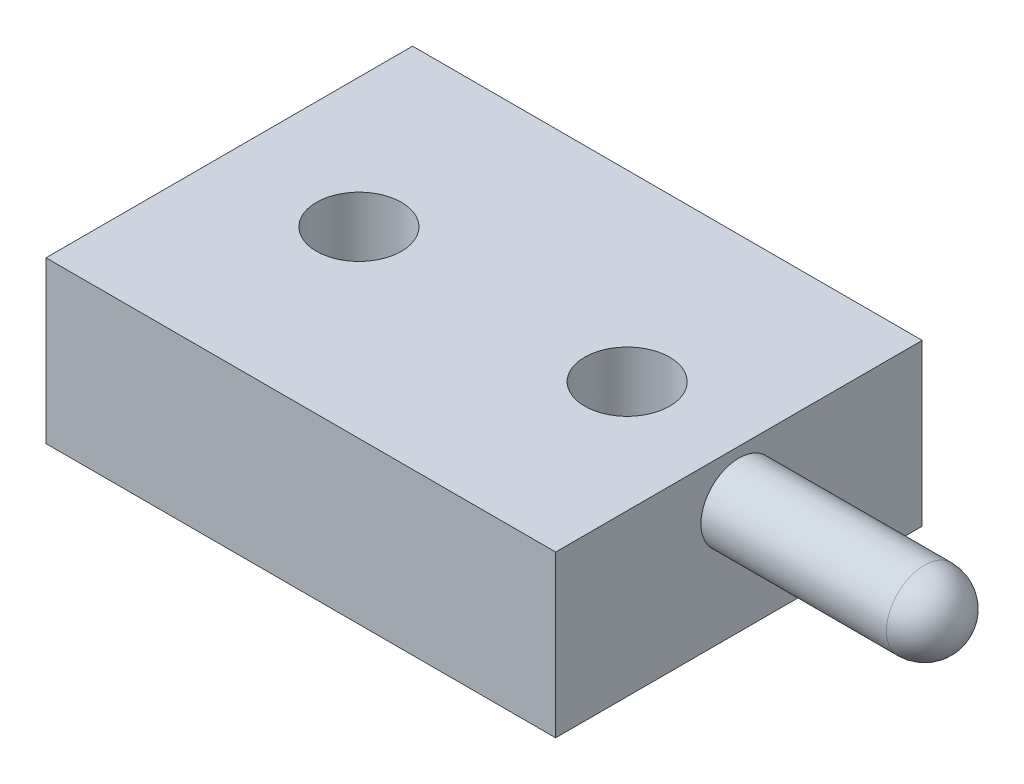
ISO-10303-21;
HEADER;
FILE_DESCRIPTION(('STEP AP214'),'2;1');
FILE_NAME('part.step','',(''),(''),'','','');
FILE_SCHEMA(('AUTOMOTIVE_DESIGN { 1 0 10303 214 1 1 1 1 }'));
ENDSEC;
DATA;
#1=APPLICATION_CONTEXT('core data for automotive mechanical design processes');
#2=APPLICATION_PROTOCOL_DEFINITION('international standard','automotive_design',2000,#1);
#3=PRODUCT_CONTEXT('',#1,'mechanical');
#4=PRODUCT('Part','Part','',(#3));
#5=PRODUCT_RELATED_PRODUCT_CATEGORY('part','',(#4));
#6=PRODUCT_DEFINITION_FORMATION('','',#4);
#7=PRODUCT_DEFINITION_CONTEXT('part definition',#1,'design');
#8=PRODUCT_DEFINITION('design','',#6,#7);
#9=PRODUCT_DEFINITION_SHAPE('','',#8);
#10=(LENGTH_UNIT() NAMED_UNIT(*) SI_UNIT(.MILLI.,.METRE.));
#11=(NAMED_UNIT(*) PLANE_ANGLE_UNIT() SI_UNIT($,.RADIAN.));
#12=(NAMED_UNIT(*) SI_UNIT($,.STERADIAN.) SOLID_ANGLE_UNIT());
#13=UNCERTAINTY_MEASURE_WITH_UNIT(LENGTH_MEASURE(1.E-05),#10,'distance_accuracy_value','');
#14=(GEOMETRIC_REPRESENTATION_CONTEXT(3) GLOBAL_UNCERTAINTY_ASSIGNED_CONTEXT((#13)) GLOBAL_UNIT_ASSIGNED_CONTEXT((#10,
#11,#12)) REPRESENTATION_CONTEXT('',''));
#15=CARTESIAN_POINT('',(0.,0.,0.));
#16=DIRECTION('',(0.,0.,1.));
#17=DIRECTION('',(1.,0.,0.));
#18=AXIS2_PLACEMENT_3D('',#15,#16,#17);
#19=CARTESIAN_POINT('',(5.7,-1.8,0.));
#20=DIRECTION('',(1.,0.,0.));
#21=DIRECTION('',(0.,0.,-1.));
#22=AXIS2_PLACEMENT_3D('',#19,#20,#21);
#23=PLANE('',#22);
#24=DIRECTION('',(0.,0.,-1.));
#25=VECTOR('',#24,1.);
#26=CARTESIAN_POINT('',(5.7,0.,0.));
#27=LINE('',#26,#25);
#28=CARTESIAN_POINT('',(5.7,0.,4.1));
#29=VERTEX_POINT('',#28);
#30=CARTESIAN_POINT('',(5.7,0.,0.));
#31=VERTEX_POINT('',#30);
#32=EDGE_CURVE('E86',#29,#31,#27,.T.);
#33=ORIENTED_EDGE('',*,*,#32,.F.);
#34=DIRECTION('',(0.,1.,0.));
#35=VECTOR('',#34,1.);
#36=CARTESIAN_POINT('',(5.7,-1.8,4.1));
#37=LINE('',#36,#35);
#38=CARTESIAN_POINT('',(5.7,-1.8,4.1));
#39=VERTEX_POINT('',#38);
#40=EDGE_CURVE('E81',#39,#29,#37,.T.);
#41=ORIENTED_EDGE('',*,*,#40,.F.);
#42=DIRECTION('',(0.,0.,-1.));
#43=VECTOR('',#42,1.);
#44=CARTESIAN_POINT('',(5.7,-1.8,0.));
#45=LINE('',#44,#43);
#46=CARTESIAN_POINT('',(5.7,-1.8,0.));
#47=VERTEX_POINT('',#46);
#48=EDGE_CURVE('E84',#39,#47,#45,.T.);
#49=ORIENTED_EDGE('',*,*,#48,.T.);
#50=DIRECTION('',(0.,1.,0.));
#51=VECTOR('',#50,1.);
#52=CARTESIAN_POINT('',(5.7,-1.8,0.));
#53=LINE('',#52,#51);
#54=EDGE_CURVE('E67',#47,#31,#53,.T.);
#55=ORIENTED_EDGE('',*,*,#54,.T.);
#56=EDGE_LOOP('',(#33,#41,#49,#55));
#57=FACE_BOUND('',#56,.T.);
#58=CARTESIAN_POINT('',(5.7,-0.54,2.05));
#59=DIRECTION('',(1.,0.,0.));
#60=DIRECTION('',(0.,0.,-1.));
#61=AXIS2_PLACEMENT_3D('',#58,#59,#60);
#62=CIRCLE('',#61,0.425);
#63=CARTESIAN_POINT('',(5.7,-0.54,1.625));
#64=VERTEX_POINT('',#63);
#65=EDGE_CURVE('E106',#64,#64,#62,.T.);
#66=ORIENTED_EDGE('',*,*,#65,.F.);
#67=EDGE_LOOP('',(#66));
#68=FACE_BOUND('',#67,.T.);
#69=ADVANCED_FACE('F34',(#57,#68),#23,.T.);
#70=CARTESIAN_POINT('',(0.,-1.8,0.));
#71=DIRECTION('',(-1.,0.,0.));
#72=DIRECTION('',(0.,0.,1.));
#73=AXIS2_PLACEMENT_3D('',#70,#71,#72);
#74=PLANE('',#73);
#75=DIRECTION('',(0.,0.,1.));
#76=VECTOR('',#75,1.);
#77=CARTESIAN_POINT('',(0.,0.,0.));
#78=LINE('',#77,#76);
#79=CARTESIAN_POINT('',(0.,0.,0.));
#80=VERTEX_POINT('',#79);
#81=CARTESIAN_POINT('',(0.,0.,4.1));
#82=VERTEX_POINT('',#81);
#83=EDGE_CURVE('E102',#80,#82,#78,.T.);
#84=ORIENTED_EDGE('',*,*,#83,.F.);
#85=DIRECTION('',(0.,1.,0.));
#86=VECTOR('',#85,1.);
#87=CARTESIAN_POINT('',(0.,-1.8,0.));
#88=LINE('',#87,#86);
#89=CARTESIAN_POINT('',(0.,-1.8,0.));
#90=VERTEX_POINT('',#89);
#91=EDGE_CURVE('E43',#90,#80,#88,.T.);
#92=ORIENTED_EDGE('',*,*,#91,.F.);
#93=DIRECTION('',(0.,0.,1.));
#94=VECTOR('',#93,1.);
#95=CARTESIAN_POINT('',(0.,-1.8,0.));
#96=LINE('',#95,#94);
#97=CARTESIAN_POINT('',(0.,-1.8,4.1));
#98=VERTEX_POINT('',#97);
#99=EDGE_CURVE('E95',#90,#98,#96,.T.);
#100=ORIENTED_EDGE('',*,*,#99,.T.);
#101=DIRECTION('',(0.,1.,0.));
#102=VECTOR('',#101,1.);
#103=CARTESIAN_POINT('',(0.,-1.8,4.1));
#104=LINE('',#103,#102);
#105=EDGE_CURVE('E78',#98,#82,#104,.T.);
#106=ORIENTED_EDGE('',*,*,#105,.T.);
#107=EDGE_LOOP('',(#84,#92,#100,#106));
#108=FACE_BOUND('',#107,.T.);
#109=ADVANCED_FACE('F112',(#108),#74,.T.);
#110=CARTESIAN_POINT('',(0.,-1.8,0.));
#111=DIRECTION('',(0.,0.,-1.));
#112=DIRECTION('',(-1.,0.,0.));
#113=AXIS2_PLACEMENT_3D('',#110,#111,#112);
#114=PLANE('',#113);
#115=DIRECTION('',(-1.,0.,0.));
#116=VECTOR('',#115,1.);
#117=CARTESIAN_POINT('',(0.,0.,0.));
#118=LINE('',#117,#116);
#119=EDGE_CURVE('E97',#31,#80,#118,.T.);
#120=ORIENTED_EDGE('',*,*,#119,.F.);
#121=ORIENTED_EDGE('',*,*,#54,.F.);
#122=DIRECTION('',(-1.,0.,0.));
#123=VECTOR('',#122,1.);
#124=CARTESIAN_POINT('',(0.,-1.8,0.));
#125=LINE('',#124,#123);
#126=EDGE_CURVE('E92',#47,#90,#125,.T.);
#127=ORIENTED_EDGE('',*,*,#126,.T.);
#128=ORIENTED_EDGE('',*,*,#91,.T.);
#129=EDGE_LOOP('',(#120,#121,#127,#128));
#130=FACE_BOUND('',#129,.T.);
#131=ADVANCED_FACE('F115',(#130),#114,.T.);
#132=CARTESIAN_POINT('',(0.,-1.8,4.1));
#133=DIRECTION('',(0.,0.,1.));
#134=DIRECTION('',(1.,0.,0.));
#135=AXIS2_PLACEMENT_3D('',#132,#133,#134);
#136=PLANE('',#135);
#137=DIRECTION('',(1.,0.,0.));
#138=VECTOR('',#137,1.);
#139=CARTESIAN_POINT('',(0.,0.,4.1));
#140=LINE('',#139,#138);
#141=EDGE_CURVE('E105',#82,#29,#140,.T.);
#142=ORIENTED_EDGE('',*,*,#141,.F.);
#143=ORIENTED_EDGE('',*,*,#105,.F.);
#144=DIRECTION('',(1.,0.,0.));
#145=VECTOR('',#144,1.);
#146=CARTESIAN_POINT('',(0.,-1.8,4.1));
#147=LINE('',#146,#145);
#148=EDGE_CURVE('E91',#98,#39,#147,.T.);
#149=ORIENTED_EDGE('',*,*,#148,.T.);
#150=ORIENTED_EDGE('',*,*,#40,.T.);
#151=EDGE_LOOP('',(#142,#143,#149,#150));
#152=FACE_BOUND('',#151,.T.);
#153=ADVANCED_FACE('F94',(#152),#136,.T.);
#154=CARTESIAN_POINT('',(0.,-1.8,0.));
#155=DIRECTION('',(0.,1.,0.));
#156=DIRECTION('',(0.,0.,1.));
#157=AXIS2_PLACEMENT_3D('',#154,#155,#156);
#158=PLANE('',#157);
#159=CARTESIAN_POINT('',(4.45,-1.8,2.05));
#160=DIRECTION('',(0.,-1.,0.));
#161=DIRECTION('',(0.,0.,-1.));
#162=AXIS2_PLACEMENT_3D('',#159,#160,#161);
#163=CIRCLE('',#162,0.474999999999999);
#164=CARTESIAN_POINT('',(4.45,-1.8,1.575));
#165=VERTEX_POINT('',#164);
#166=EDGE_CURVE('E222',#165,#165,#163,.T.);
#167=ORIENTED_EDGE('',*,*,#166,.F.);
#168=EDGE_LOOP('',(#167));
#169=FACE_BOUND('',#168,.T.);
#170=CARTESIAN_POINT('',(1.45,-1.8,2.05));
#171=DIRECTION('',(0.,-1.,0.));
#172=DIRECTION('',(0.,0.,-1.));
#173=AXIS2_PLACEMENT_3D('',#170,#171,#172);
#174=CIRCLE('',#173,0.474999999999999);
#175=CARTESIAN_POINT('',(1.45,-1.8,1.575));
#176=VERTEX_POINT('',#175);
#177=EDGE_CURVE('E224',#176,#176,#174,.T.);
#178=ORIENTED_EDGE('',*,*,#177,.F.);
#179=EDGE_LOOP('',(#178));
#180=FACE_BOUND('',#179,.T.);
#181=ORIENTED_EDGE('',*,*,#99,.F.);
#182=ORIENTED_EDGE('',*,*,#126,.F.);
#183=ORIENTED_EDGE('',*,*,#48,.F.);
#184=ORIENTED_EDGE('',*,*,#148,.F.);
#185=EDGE_LOOP('',(#181,#182,#183,#184));
#186=FACE_BOUND('',#185,.T.);
#187=ADVANCED_FACE('F90',(#169,#180,#186),#158,.F.);
#188=CARTESIAN_POINT('',(0.,0.,0.));
#189=DIRECTION('',(0.,1.,0.));
#190=DIRECTION('',(0.,0.,1.));
#191=AXIS2_PLACEMENT_3D('',#188,#189,#190);
#192=PLANE('',#191);
#193=CARTESIAN_POINT('',(4.45,0.,2.05));
#194=DIRECTION('',(0.,1.,0.));
#195=DIRECTION('',(0.,0.,1.));
#196=AXIS2_PLACEMENT_3D('',#193,#194,#195);
#197=CIRCLE('',#196,0.474999999999998);
#198=CARTESIAN_POINT('',(4.45,0.,2.525));
#199=VERTEX_POINT('',#198);
#200=EDGE_CURVE('E219',#199,#199,#197,.T.);
#201=ORIENTED_EDGE('',*,*,#200,.F.);
#202=EDGE_LOOP('',(#201));
#203=FACE_BOUND('',#202,.T.);
#204=CARTESIAN_POINT('',(1.45,0.,2.05));
#205=DIRECTION('',(0.,1.,0.));
#206=DIRECTION('',(0.,0.,1.));
#207=AXIS2_PLACEMENT_3D('',#204,#205,#206);
#208=CIRCLE('',#207,0.474999999999999);
#209=CARTESIAN_POINT('',(1.45,0.,2.525));
#210=VERTEX_POINT('',#209);
#211=EDGE_CURVE('E229',#210,#210,#208,.T.);
#212=ORIENTED_EDGE('',*,*,#211,.F.);
#213=EDGE_LOOP('',(#212));
#214=FACE_BOUND('',#213,.T.);
#215=ORIENTED_EDGE('',*,*,#83,.T.);
#216=ORIENTED_EDGE('',*,*,#141,.T.);
#217=ORIENTED_EDGE('',*,*,#32,.T.);
#218=ORIENTED_EDGE('',*,*,#119,.T.);
#219=EDGE_LOOP('',(#215,#216,#217,#218));
#220=FACE_BOUND('',#219,.T.);
#221=ADVANCED_FACE('F114',(#203,#214,#220),#192,.T.);
#222=CARTESIAN_POINT('',(8.2,-0.54,2.05));
#223=DIRECTION('',(-1.,0.,0.));
#224=DIRECTION('',(0.,0.,1.));
#225=AXIS2_PLACEMENT_3D('',#222,#223,#224);
#226=CYLINDRICAL_SURFACE('',#225,0.425);
#227=CARTESIAN_POINT('',(7.775,-0.54,2.05));
#228=DIRECTION('',(-1.,0.,0.));
#229=DIRECTION('',(0.,0.,1.));
#230=AXIS2_PLACEMENT_3D('',#227,#228,#229);
#231=CIRCLE('',#230,0.425);
#232=CARTESIAN_POINT('',(7.775,-0.54,2.475));
#233=VERTEX_POINT('',#232);
#234=EDGE_CURVE('E11',#233,#233,#231,.T.);
#235=ORIENTED_EDGE('',*,*,#234,.T.);
#236=EDGE_LOOP('',(#235));
#237=FACE_BOUND('',#236,.T.);
#238=ORIENTED_EDGE('',*,*,#65,.T.);
#239=EDGE_LOOP('',(#238));
#240=FACE_BOUND('',#239,.T.);
#241=ADVANCED_FACE('F159',(#237,#240),#226,.T.);
#242=CARTESIAN_POINT('',(7.775,-0.54,2.05));
#243=DIRECTION('',(0.,0.,1.));
#244=DIRECTION('',(1.,0.,0.));
#245=AXIS2_PLACEMENT_3D('',#242,#243,#244);
#246=SPHERICAL_SURFACE('',#245,0.425);
#247=CARTESIAN_POINT('',(7.775,-0.54,2.05));
#248=DIRECTION('',(-1.,0.,0.));
#249=DIRECTION('',(0.,0.,1.));
#250=AXIS2_PLACEMENT_3D('',#247,#248,#249);
#251=SPHERICAL_SURFACE('',#250,0.425);
#252=ORIENTED_EDGE('',*,*,#234,.F.);
#253=EDGE_LOOP('',(#252));
#254=FACE_BOUND('',#253,.T.);
#255=ADVANCED_FACE('F36',(#254),#251,.T.);
#256=CARTESIAN_POINT('',(1.45,-1.8,2.05));
#257=DIRECTION('',(0.,-1.,0.));
#258=DIRECTION('',(0.,0.,-1.));
#259=AXIS2_PLACEMENT_3D('',#256,#257,#258);
#260=CYLINDRICAL_SURFACE('',#259,0.474999999999999);
#261=ORIENTED_EDGE('',*,*,#211,.T.);
#262=EDGE_LOOP('',(#261));
#263=FACE_BOUND('',#262,.T.);
#264=ORIENTED_EDGE('',*,*,#177,.T.);
#265=EDGE_LOOP('',(#264));
#266=FACE_BOUND('',#265,.T.);
#267=ADVANCED_FACE('F172',(#263,#266),#260,.F.);
#268=CARTESIAN_POINT('',(4.45,-1.8,2.05));
#269=DIRECTION('',(0.,-1.,0.));
#270=DIRECTION('',(0.,0.,-1.));
#271=AXIS2_PLACEMENT_3D('',#268,#269,#270);
#272=CYLINDRICAL_SURFACE('',#271,0.474999999999998);
#273=ORIENTED_EDGE('',*,*,#200,.T.);
#274=EDGE_LOOP('',(#273));
#275=FACE_BOUND('',#274,.T.);
#276=ORIENTED_EDGE('',*,*,#166,.T.);
#277=EDGE_LOOP('',(#276));
#278=FACE_BOUND('',#277,.T.);
#279=ADVANCED_FACE('F179',(#275,#278),#272,.F.);
#280=CLOSED_SHELL('',(#69,#109,#131,#153,#187,#221,#241,#255,#267,#279));
#281=MANIFOLD_SOLID_BREP('B2',#280);
#282=ADVANCED_BREP_SHAPE_REPRESENTATION('',(#18,#281),#14);
#283=SHAPE_DEFINITION_REPRESENTATION(#9,#282);
ENDSEC;
END-ISO-10303-21;
